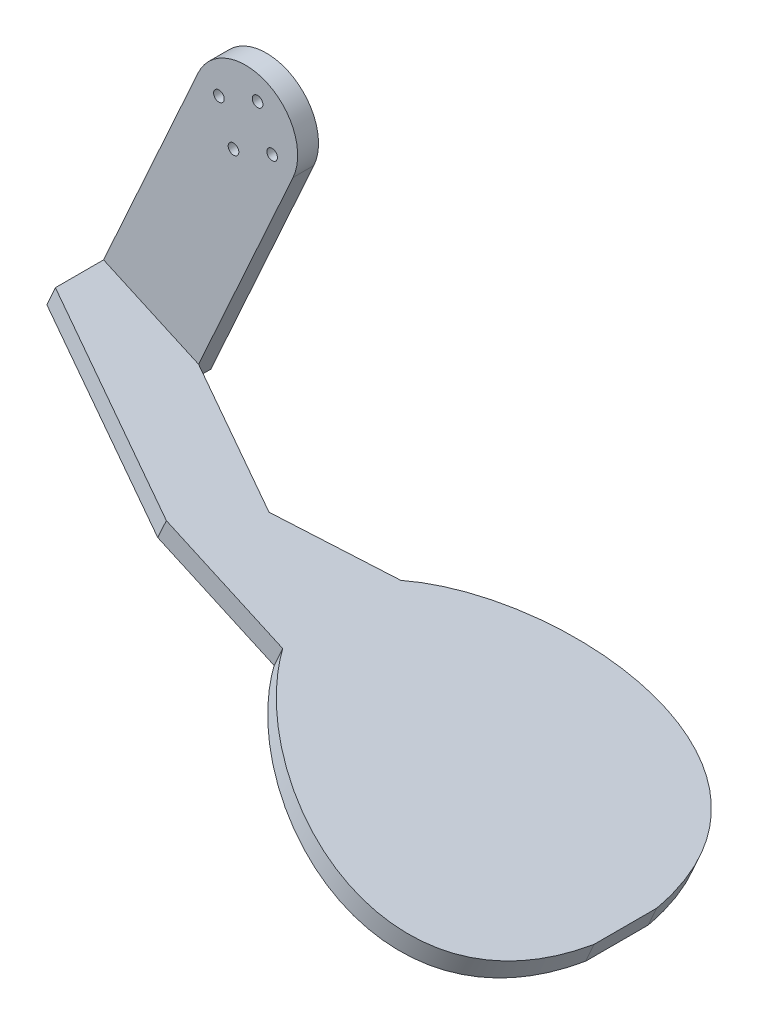
ISO-10303-21;
HEADER;
FILE_DESCRIPTION(('STEP AP214'),'2;1');
FILE_NAME('part.step','',(''),(''),'','','');
FILE_SCHEMA(('AUTOMOTIVE_DESIGN { 1 0 10303 214 1 1 1 1 }'));
ENDSEC;
DATA;
#1=APPLICATION_CONTEXT('core data for automotive mechanical design processes');
#2=APPLICATION_PROTOCOL_DEFINITION('international standard','automotive_design',2000,#1);
#3=PRODUCT_CONTEXT('',#1,'mechanical');
#4=PRODUCT('Part','Part','',(#3));
#5=PRODUCT_RELATED_PRODUCT_CATEGORY('part','',(#4));
#6=PRODUCT_DEFINITION_FORMATION('','',#4);
#7=PRODUCT_DEFINITION_CONTEXT('part definition',#1,'design');
#8=PRODUCT_DEFINITION('design','',#6,#7);
#9=PRODUCT_DEFINITION_SHAPE('','',#8);
#10=(LENGTH_UNIT() NAMED_UNIT(*) SI_UNIT(.MILLI.,.METRE.));
#11=(NAMED_UNIT(*) PLANE_ANGLE_UNIT() SI_UNIT($,.RADIAN.));
#12=(NAMED_UNIT(*) SI_UNIT($,.STERADIAN.) SOLID_ANGLE_UNIT());
#13=UNCERTAINTY_MEASURE_WITH_UNIT(LENGTH_MEASURE(1.E-05),#10,'distance_accuracy_value','');
#14=(GEOMETRIC_REPRESENTATION_CONTEXT(3) GLOBAL_UNCERTAINTY_ASSIGNED_CONTEXT((#13)) GLOBAL_UNIT_ASSIGNED_CONTEXT((#10,
#11,#12)) REPRESENTATION_CONTEXT('',''));
#15=CARTESIAN_POINT('',(0.,0.,0.));
#16=DIRECTION('',(0.,0.,1.));
#17=DIRECTION('',(1.,0.,0.));
#18=AXIS2_PLACEMENT_3D('',#15,#16,#17);
#19=CARTESIAN_POINT('',(0.,0.,3.));
#20=DIRECTION('',(0.,0.,1.));
#21=DIRECTION('',(1.,0.,0.));
#22=AXIS2_PLACEMENT_3D('',#19,#20,#21);
#23=PLANE('',#22);
#24=CARTESIAN_POINT('',(-6.37863219193464,2.88323626503544,3.));
#25=DIRECTION('',(0.,0.,1.));
#26=DIRECTION('',(-1.,0.,0.));
#27=AXIS2_PLACEMENT_3D('',#24,#25,#26);
#28=CIRCLE('',#27,1.275);
#29=CARTESIAN_POINT('',(-7.65363219193464,2.88323626503544,3.));
#30=VERTEX_POINT('',#29);
#31=EDGE_CURVE('E263',#30,#30,#28,.T.);
#32=ORIENTED_EDGE('',*,*,#31,.F.);
#33=EDGE_LOOP('',(#32));
#34=FACE_BOUND('',#33,.T.);
#35=CARTESIAN_POINT('',(2.88323626503541,6.37863219193461,3.));
#36=DIRECTION('',(0.,0.,1.));
#37=DIRECTION('',(1.,0.,0.));
#38=AXIS2_PLACEMENT_3D('',#35,#36,#37);
#39=CIRCLE('',#38,1.275);
#40=CARTESIAN_POINT('',(4.15823626503541,6.37863219193461,3.));
#41=VERTEX_POINT('',#40);
#42=EDGE_CURVE('E11',#41,#41,#39,.T.);
#43=ORIENTED_EDGE('',*,*,#42,.F.);
#44=EDGE_LOOP('',(#43));
#45=FACE_BOUND('',#44,.T.);
#46=CARTESIAN_POINT('',(-2.88323626503547,-6.37863219193462,3.));
#47=DIRECTION('',(0.,0.,1.));
#48=DIRECTION('',(-1.,0.,0.));
#49=AXIS2_PLACEMENT_3D('',#46,#47,#48);
#50=CIRCLE('',#49,1.275);
#51=CARTESIAN_POINT('',(-4.15823626503547,-6.37863219193462,3.));
#52=VERTEX_POINT('',#51);
#53=EDGE_CURVE('E42',#52,#52,#50,.T.);
#54=ORIENTED_EDGE('',*,*,#53,.F.);
#55=EDGE_LOOP('',(#54));
#56=FACE_BOUND('',#55,.T.);
#57=CARTESIAN_POINT('',(6.37863219193458,-2.88323626503544,3.));
#58=DIRECTION('',(0.,0.,1.));
#59=DIRECTION('',(1.,0.,0.));
#60=AXIS2_PLACEMENT_3D('',#57,#58,#59);
#61=CIRCLE('',#60,1.275);
#62=CARTESIAN_POINT('',(7.65363219193458,-2.88323626503544,3.));
#63=VERTEX_POINT('',#62);
#64=EDGE_CURVE('E256',#63,#63,#61,.T.);
#65=ORIENTED_EDGE('',*,*,#64,.F.);
#66=EDGE_LOOP('',(#65));
#67=FACE_BOUND('',#66,.T.);
#68=DIRECTION('',(-0.411890895005062,-0.911233170276373,0.));
#69=VECTOR('',#68,1.);
#70=CARTESIAN_POINT('',(-11.3904146284547,5.14863618756329,3.));
#71=LINE('',#70,#69);
#72=CARTESIAN_POINT('',(-11.3904146284547,5.14863618756329,3.));
#73=VERTEX_POINT('',#72);
#74=CARTESIAN_POINT('',(-34.0444138537331,-44.9691881776372,3.));
#75=VERTEX_POINT('',#74);
#76=EDGE_CURVE('E54',#73,#75,#71,.T.);
#77=ORIENTED_EDGE('',*,*,#76,.T.);
#78=DIRECTION('',(0.911233170276373,-0.411890895005062,0.));
#79=VECTOR('',#78,1.);
#80=CARTESIAN_POINT('',(-34.0444138537331,-44.9691881776373,3.));
#81=LINE('',#80,#79);
#82=CARTESIAN_POINT('',(-11.2635845968238,-55.2664605527638,3.));
#83=VERTEX_POINT('',#82);
#84=EDGE_CURVE('E49',#75,#83,#81,.T.);
#85=ORIENTED_EDGE('',*,*,#84,.T.);
#86=DIRECTION('',(0.411890895005062,0.911233170276373,0.));
#87=VECTOR('',#86,1.);
#88=CARTESIAN_POINT('',(11.3904146284546,-5.14863618756328,3.));
#89=LINE('',#88,#87);
#90=CARTESIAN_POINT('',(11.3904146284546,-5.14863618756328,3.));
#91=VERTEX_POINT('',#90);
#92=EDGE_CURVE('E250',#83,#91,#89,.T.);
#93=ORIENTED_EDGE('',*,*,#92,.T.);
#94=CARTESIAN_POINT('',(0.,0.,3.));
#95=DIRECTION('',(0.,0.,1.));
#96=DIRECTION('',(1.,0.,0.));
#97=AXIS2_PLACEMENT_3D('',#94,#95,#96);
#98=CIRCLE('',#97,12.5);
#99=EDGE_CURVE('E227',#91,#73,#98,.T.);
#100=ORIENTED_EDGE('',*,*,#99,.T.);
#101=EDGE_LOOP('',(#77,#85,#93,#100));
#102=FACE_BOUND('',#101,.T.);
#103=ADVANCED_FACE('F35',(#34,#45,#56,#67,#102),#23,.T.);
#104=CARTESIAN_POINT('',(2.88323626503541,6.37863219193461,3.));
#105=DIRECTION('',(0.,0.,-1.));
#106=DIRECTION('',(-1.,0.,0.));
#107=AXIS2_PLACEMENT_3D('',#104,#105,#106);
#108=CYLINDRICAL_SURFACE('',#107,1.275);
#109=ORIENTED_EDGE('',*,*,#42,.T.);
#110=EDGE_LOOP('',(#109));
#111=FACE_BOUND('',#110,.T.);
#112=CARTESIAN_POINT('',(2.88323626503541,6.37863219193461,-2.));
#113=DIRECTION('',(0.,0.,1.));
#114=DIRECTION('',(1.,0.,0.));
#115=AXIS2_PLACEMENT_3D('',#112,#113,#114);
#116=CIRCLE('',#115,1.275);
#117=CARTESIAN_POINT('',(4.15823626503541,6.37863219193461,-2.));
#118=VERTEX_POINT('',#117);
#119=EDGE_CURVE('E225',#118,#118,#116,.T.);
#120=ORIENTED_EDGE('',*,*,#119,.F.);
#121=EDGE_LOOP('',(#120));
#122=FACE_BOUND('',#121,.T.);
#123=ADVANCED_FACE('F213',(#111,#122),#108,.F.);
#124=CARTESIAN_POINT('',(-2.88323626503547,-6.37863219193462,3.));
#125=DIRECTION('',(0.,0.,-1.));
#126=DIRECTION('',(-1.,0.,0.));
#127=AXIS2_PLACEMENT_3D('',#124,#125,#126);
#128=CYLINDRICAL_SURFACE('',#127,1.275);
#129=ORIENTED_EDGE('',*,*,#53,.T.);
#130=EDGE_LOOP('',(#129));
#131=FACE_BOUND('',#130,.T.);
#132=CARTESIAN_POINT('',(-2.88323626503546,-6.37863219193461,-2.));
#133=DIRECTION('',(0.,0.,1.));
#134=DIRECTION('',(-1.,0.,0.));
#135=AXIS2_PLACEMENT_3D('',#132,#133,#134);
#136=CIRCLE('',#135,1.275);
#137=CARTESIAN_POINT('',(-4.15823626503546,-6.37863219193461,-2.));
#138=VERTEX_POINT('',#137);
#139=EDGE_CURVE('E228',#138,#138,#136,.T.);
#140=ORIENTED_EDGE('',*,*,#139,.F.);
#141=EDGE_LOOP('',(#140));
#142=FACE_BOUND('',#141,.T.);
#143=ADVANCED_FACE('F210',(#131,#142),#128,.F.);
#144=CARTESIAN_POINT('',(-6.37863219193464,2.88323626503544,3.));
#145=DIRECTION('',(0.,0.,-1.));
#146=DIRECTION('',(-1.,0.,0.));
#147=AXIS2_PLACEMENT_3D('',#144,#145,#146);
#148=CYLINDRICAL_SURFACE('',#147,1.275);
#149=ORIENTED_EDGE('',*,*,#31,.T.);
#150=EDGE_LOOP('',(#149));
#151=FACE_BOUND('',#150,.T.);
#152=CARTESIAN_POINT('',(-6.37863219193464,2.88323626503543,-2.));
#153=DIRECTION('',(0.,0.,1.));
#154=DIRECTION('',(-1.,0.,0.));
#155=AXIS2_PLACEMENT_3D('',#152,#153,#154);
#156=CIRCLE('',#155,1.275);
#157=CARTESIAN_POINT('',(-7.65363219193464,2.88323626503543,-2.));
#158=VERTEX_POINT('',#157);
#159=EDGE_CURVE('E232',#158,#158,#156,.T.);
#160=ORIENTED_EDGE('',*,*,#159,.F.);
#161=EDGE_LOOP('',(#160));
#162=FACE_BOUND('',#161,.T.);
#163=ADVANCED_FACE('F206',(#151,#162),#148,.F.);
#164=CARTESIAN_POINT('',(6.37863219193458,-2.88323626503544,3.));
#165=DIRECTION('',(0.,0.,-1.));
#166=DIRECTION('',(-1.,0.,0.));
#167=AXIS2_PLACEMENT_3D('',#164,#165,#166);
#168=CYLINDRICAL_SURFACE('',#167,1.275);
#169=ORIENTED_EDGE('',*,*,#64,.T.);
#170=EDGE_LOOP('',(#169));
#171=FACE_BOUND('',#170,.T.);
#172=CARTESIAN_POINT('',(6.37863219193458,-2.88323626503544,-2.));
#173=DIRECTION('',(0.,0.,1.));
#174=DIRECTION('',(1.,0.,0.));
#175=AXIS2_PLACEMENT_3D('',#172,#173,#174);
#176=CIRCLE('',#175,1.275);
#177=CARTESIAN_POINT('',(7.65363219193458,-2.88323626503544,-2.));
#178=VERTEX_POINT('',#177);
#179=EDGE_CURVE('E274',#178,#178,#176,.T.);
#180=ORIENTED_EDGE('',*,*,#179,.F.);
#181=EDGE_LOOP('',(#180));
#182=FACE_BOUND('',#181,.T.);
#183=ADVANCED_FACE('F202',(#171,#182),#168,.F.);
#184=CARTESIAN_POINT('',(0.,0.,-2.));
#185=DIRECTION('',(0.,0.,1.));
#186=DIRECTION('',(1.,0.,0.));
#187=AXIS2_PLACEMENT_3D('',#184,#185,#186);
#188=CYLINDRICAL_SURFACE('',#187,12.5);
#189=ORIENTED_EDGE('',*,*,#99,.F.);
#190=DIRECTION('',(0.,0.,1.));
#191=VECTOR('',#190,1.);
#192=CARTESIAN_POINT('',(11.3904146284546,-5.14863618756328,-2.));
#193=LINE('',#192,#191);
#194=CARTESIAN_POINT('',(11.3904146284546,-5.14863618756328,-2.));
#195=VERTEX_POINT('',#194);
#196=EDGE_CURVE('E253',#195,#91,#193,.T.);
#197=ORIENTED_EDGE('',*,*,#196,.F.);
#198=CARTESIAN_POINT('',(0.,0.,-2.));
#199=DIRECTION('',(0.,0.,1.));
#200=DIRECTION('',(1.,0.,0.));
#201=AXIS2_PLACEMENT_3D('',#198,#199,#200);
#202=CIRCLE('',#201,12.5);
#203=CARTESIAN_POINT('',(-11.3904146284547,5.14863618756329,-2.));
#204=VERTEX_POINT('',#203);
#205=EDGE_CURVE('E236',#195,#204,#202,.T.);
#206=ORIENTED_EDGE('',*,*,#205,.T.);
#207=DIRECTION('',(0.,0.,1.));
#208=VECTOR('',#207,1.);
#209=CARTESIAN_POINT('',(-11.3904146284547,5.14863618756329,-2.));
#210=LINE('',#209,#208);
#211=EDGE_CURVE('E247',#204,#73,#210,.T.);
#212=ORIENTED_EDGE('',*,*,#211,.T.);
#213=EDGE_LOOP('',(#189,#197,#206,#212));
#214=FACE_BOUND('',#213,.T.);
#215=ADVANCED_FACE('F193',(#214),#188,.T.);
#216=CARTESIAN_POINT('',(11.3904146284546,-5.14863618756328,-2.));
#217=DIRECTION('',(0.911233170276373,-0.411890895005062,0.));
#218=DIRECTION('',(0.411890895005062,0.911233170276373,0.));
#219=AXIS2_PLACEMENT_3D('',#216,#217,#218);
#220=PLANE('',#219);
#221=CARTESIAN_POINT('',(-13.3230390718491,-59.8226264041457,3.));
#222=VERTEX_POINT('',#221);
#223=EDGE_CURVE('E240',#222,#83,#89,.T.);
#224=ORIENTED_EDGE('',*,*,#223,.F.);
#225=DIRECTION('',(0.,0.,1.));
#226=VECTOR('',#225,1.);
#227=CARTESIAN_POINT('',(-13.3230390718491,-59.8226264041457,-2.));
#228=LINE('',#227,#226);
#229=CARTESIAN_POINT('',(-13.3230390718491,-59.8226264041457,-2.));
#230=VERTEX_POINT('',#229);
#231=EDGE_CURVE('E257',#230,#222,#228,.T.);
#232=ORIENTED_EDGE('',*,*,#231,.F.);
#233=DIRECTION('',(0.411890895005062,0.911233170276373,0.));
#234=VECTOR('',#233,1.);
#235=CARTESIAN_POINT('',(11.3904146284546,-5.14863618756328,-2.));
#236=LINE('',#235,#234);
#237=EDGE_CURVE('E245',#230,#195,#236,.T.);
#238=ORIENTED_EDGE('',*,*,#237,.T.);
#239=ORIENTED_EDGE('',*,*,#196,.T.);
#240=ORIENTED_EDGE('',*,*,#92,.F.);
#241=EDGE_LOOP('',(#224,#232,#238,#239,#240));
#242=FACE_BOUND('',#241,.T.);
#243=ADVANCED_FACE('F189',(#242),#220,.T.);
#244=CARTESIAN_POINT('',(-13.3230390718491,-59.8226264041457,-2.));
#245=DIRECTION('',(-0.411890895005062,-0.911233170276373,0.));
#246=DIRECTION('',(0.911233170276373,-0.411890895005062,0.));
#247=AXIS2_PLACEMENT_3D('',#244,#245,#246);
#248=PLANE('',#247);
#249=ORIENTED_EDGE('',*,*,#231,.T.);
#250=DIRECTION('',(0.862608684222671,-0.389911906823864,0.322296389710792));
#251=VECTOR('',#250,1.);
#252=CARTESIAN_POINT('',(-13.323039071849,-59.8226264041457,3.));
#253=LINE('',#252,#251);
#254=CARTESIAN_POINT('',(13.6509057318031,-72.0152491371655,13.0782720896317));
#255=VERTEX_POINT('',#254);
#256=EDGE_CURVE('E309',#222,#255,#253,.T.);
#257=ORIENTED_EDGE('',*,*,#256,.T.);
#258=DIRECTION('',(0.819925869175354,-0.370618641977235,-0.436306533615977));
#259=VECTOR('',#258,1.);
#260=CARTESIAN_POINT('',(34.2779269582144,-81.3389683688284,2.10203086044572));
#261=LINE('',#260,#259);
#262=CARTESIAN_POINT('',(34.2779269582144,-81.3389683688284,2.10203086044572));
#263=VERTEX_POINT('',#262);
#264=EDGE_CURVE('E303',#255,#263,#261,.T.);
#265=ORIENTED_EDGE('',*,*,#264,.T.);
#266=CARTESIAN_POINT('',(34.2779269582144,-81.3389683688284,2.10203086044572));
#267=CARTESIAN_POINT('',(49.7906158920743,-88.3509336235225,-22.4198920206127));
#268=CARTESIAN_POINT('',(96.1335855652667,-109.298642594756,-37.6494657311894));
#269=CARTESIAN_POINT('',(102.29569044997,-112.084005308567,8.7620308604458));
#270=B_SPLINE_CURVE_WITH_KNOTS('',3,(#266,#267,#268,#269),.UNSPECIFIED.,.F.,.F.,(4,4),(0.,1.),.UNSPECIFIED.);
#271=CARTESIAN_POINT('',(102.29569044997,-112.084005308567,8.7620308604458));
#272=VERTEX_POINT('',#271);
#273=EDGE_CURVE('E298',#263,#272,#270,.T.);
#274=ORIENTED_EDGE('',*,*,#273,.T.);
#275=DIRECTION('',(0.,0.,1.));
#276=VECTOR('',#275,1.);
#277=CARTESIAN_POINT('',(102.29569044997,-112.084005308567,8.7620308604458));
#278=LINE('',#277,#276);
#279=CARTESIAN_POINT('',(102.29569044997,-112.084005308567,23.7620308604458));
#280=VERTEX_POINT('',#279);
#281=EDGE_CURVE('E292',#272,#280,#278,.T.);
#282=ORIENTED_EDGE('',*,*,#281,.T.);
#283=CARTESIAN_POINT('',(102.29569044997,-112.084005308567,23.7620308604458));
#284=CARTESIAN_POINT('',(96.1335855652869,-109.298642594765,70.1735274521018));
#285=CARTESIAN_POINT('',(49.7906158920543,-88.3509336235135,54.943953741536));
#286=CARTESIAN_POINT('',(34.2779269582145,-81.3389683688284,30.4220308604457));
#287=B_SPLINE_CURVE_WITH_KNOTS('',3,(#283,#284,#285,#286),.UNSPECIFIED.,.F.,.F.,(4,4),(0.,1.),.UNSPECIFIED.);
#288=CARTESIAN_POINT('',(34.2779269582145,-81.3389683688284,30.4220308604457));
#289=VERTEX_POINT('',#288);
#290=EDGE_CURVE('E145',#280,#289,#287,.T.);
#291=ORIENTED_EDGE('',*,*,#290,.T.);
#292=DIRECTION('',(-0.911233170276373,0.411890895005062,0.));
#293=VECTOR('',#292,1.);
#294=CARTESIAN_POINT('',(34.2779269582145,-81.3389683688284,30.4220308604457));
#295=LINE('',#294,#293);
#296=CARTESIAN_POINT('',(6.37334244186484,-68.7256826960761,30.4220308604457));
#297=VERTEX_POINT('',#296);
#298=EDGE_CURVE('E142',#289,#297,#295,.T.);
#299=ORIENTED_EDGE('',*,*,#298,.T.);
#300=DIRECTION('',(-0.862608684222672,0.389911906823864,-0.322296389710791));
#301=VECTOR('',#300,1.);
#302=CARTESIAN_POINT('',(-36.1038683287584,-49.5253540290191,14.551275178577));
#303=LINE('',#302,#301);
#304=CARTESIAN_POINT('',(-36.1038683287584,-49.5253540290191,14.551275178577));
#305=VERTEX_POINT('',#304);
#306=EDGE_CURVE('E312',#297,#305,#303,.T.);
#307=ORIENTED_EDGE('',*,*,#306,.T.);
#308=DIRECTION('',(0.,0.,1.));
#309=VECTOR('',#308,1.);
#310=CARTESIAN_POINT('',(-36.1038683287584,-49.5253540290191,-2.));
#311=LINE('',#310,#309);
#312=CARTESIAN_POINT('',(-36.1038683287584,-49.5253540290191,-2.));
#313=VERTEX_POINT('',#312);
#314=EDGE_CURVE('E124',#313,#305,#311,.T.);
#315=ORIENTED_EDGE('',*,*,#314,.F.);
#316=DIRECTION('',(0.911233170276373,-0.411890895005062,0.));
#317=VECTOR('',#316,1.);
#318=CARTESIAN_POINT('',(-13.3230390718491,-59.8226264041457,-2.));
#319=LINE('',#318,#317);
#320=EDGE_CURVE('E242',#313,#230,#319,.T.);
#321=ORIENTED_EDGE('',*,*,#320,.T.);
#322=EDGE_LOOP('',(#249,#257,#265,#274,#282,#291,#299,#307,#315,#321));
#323=FACE_BOUND('',#322,.T.);
#324=ADVANCED_FACE('F192',(#323),#248,.T.);
#325=CARTESIAN_POINT('',(-11.3904146284547,5.14863618756329,-2.));
#326=DIRECTION('',(-0.911233170276373,0.411890895005062,0.));
#327=DIRECTION('',(-0.411890895005062,-0.911233170276373,0.));
#328=AXIS2_PLACEMENT_3D('',#325,#326,#327);
#329=PLANE('',#328);
#330=ORIENTED_EDGE('',*,*,#76,.F.);
#331=ORIENTED_EDGE('',*,*,#211,.F.);
#332=DIRECTION('',(-0.411890895005062,-0.911233170276373,0.));
#333=VECTOR('',#332,1.);
#334=CARTESIAN_POINT('',(-11.3904146284547,5.14863618756329,-2.));
#335=LINE('',#334,#333);
#336=EDGE_CURVE('E239',#204,#313,#335,.T.);
#337=ORIENTED_EDGE('',*,*,#336,.T.);
#338=ORIENTED_EDGE('',*,*,#314,.T.);
#339=DIRECTION('',(-0.411890895005062,-0.911233170276373,0.));
#340=VECTOR('',#339,1.);
#341=CARTESIAN_POINT('',(-34.0444138537331,-44.9691881776372,14.551275178577));
#342=LINE('',#341,#340);
#343=CARTESIAN_POINT('',(-34.0444138537331,-44.9691881776372,14.551275178577));
#344=VERTEX_POINT('',#343);
#345=EDGE_CURVE('E119',#344,#305,#342,.T.);
#346=ORIENTED_EDGE('',*,*,#345,.F.);
#347=DIRECTION('',(0.,0.,-1.));
#348=VECTOR('',#347,1.);
#349=CARTESIAN_POINT('',(-34.0444138537331,-44.9691881776373,3.));
#350=LINE('',#349,#348);
#351=EDGE_CURVE('E122',#344,#75,#350,.T.);
#352=ORIENTED_EDGE('',*,*,#351,.T.);
#353=EDGE_LOOP('',(#330,#331,#337,#338,#346,#352));
#354=FACE_BOUND('',#353,.T.);
#355=ADVANCED_FACE('F121',(#354),#329,.T.);
#356=CARTESIAN_POINT('',(0.,0.,-2.));
#357=DIRECTION('',(0.,0.,1.));
#358=DIRECTION('',(1.,0.,0.));
#359=AXIS2_PLACEMENT_3D('',#356,#357,#358);
#360=PLANE('',#359);
#361=ORIENTED_EDGE('',*,*,#179,.T.);
#362=EDGE_LOOP('',(#361));
#363=FACE_BOUND('',#362,.T.);
#364=ORIENTED_EDGE('',*,*,#159,.T.);
#365=EDGE_LOOP('',(#364));
#366=FACE_BOUND('',#365,.T.);
#367=ORIENTED_EDGE('',*,*,#139,.T.);
#368=EDGE_LOOP('',(#367));
#369=FACE_BOUND('',#368,.T.);
#370=ORIENTED_EDGE('',*,*,#119,.T.);
#371=EDGE_LOOP('',(#370));
#372=FACE_BOUND('',#371,.T.);
#373=ORIENTED_EDGE('',*,*,#205,.F.);
#374=ORIENTED_EDGE('',*,*,#237,.F.);
#375=ORIENTED_EDGE('',*,*,#320,.F.);
#376=ORIENTED_EDGE('',*,*,#336,.F.);
#377=EDGE_LOOP('',(#373,#374,#375,#376));
#378=FACE_BOUND('',#377,.T.);
#379=ADVANCED_FACE('F185',(#363,#366,#369,#372,#378),#360,.F.);
#380=CARTESIAN_POINT('',(-34.0444138537331,-44.9691881776372,14.551275178577));
#381=DIRECTION('',(-0.293687160964794,0.132750948414878,0.946638810306967));
#382=DIRECTION('',(0.955091921536743,0.,0.2963096714845));
#383=AXIS2_PLACEMENT_3D('',#380,#381,#382);
#384=PLANE('',#383);
#385=ORIENTED_EDGE('',*,*,#306,.F.);
#386=DIRECTION('',(-0.411890895005062,-0.911233170276373,0.));
#387=VECTOR('',#386,1.);
#388=CARTESIAN_POINT('',(8.43279691689015,-64.1695168446942,30.4220308604457));
#389=LINE('',#388,#387);
#390=CARTESIAN_POINT('',(8.43279691689015,-64.1695168446942,30.4220308604457));
#391=VERTEX_POINT('',#390);
#392=EDGE_CURVE('E141',#391,#297,#389,.T.);
#393=ORIENTED_EDGE('',*,*,#392,.F.);
#394=DIRECTION('',(-0.862608684222672,0.389911906823864,-0.322296389710791));
#395=VECTOR('',#394,1.);
#396=CARTESIAN_POINT('',(-34.0444138537331,-44.9691881776372,14.551275178577));
#397=LINE('',#396,#395);
#398=EDGE_CURVE('E136',#391,#344,#397,.T.);
#399=ORIENTED_EDGE('',*,*,#398,.T.);
#400=ORIENTED_EDGE('',*,*,#345,.T.);
#401=EDGE_LOOP('',(#385,#393,#399,#400));
#402=FACE_BOUND('',#401,.T.);
#403=ADVANCED_FACE('F140',(#402),#384,.T.);
#404=CARTESIAN_POINT('',(36.3373814332398,-76.7828025174466,30.4220308604457));
#405=DIRECTION('',(0.,0.,1.));
#406=DIRECTION('',(1.,0.,0.));
#407=AXIS2_PLACEMENT_3D('',#404,#405,#406);
#408=PLANE('',#407);
#409=ORIENTED_EDGE('',*,*,#298,.F.);
#410=DIRECTION('',(-0.411890895005062,-0.911233170276373,0.));
#411=VECTOR('',#410,1.);
#412=CARTESIAN_POINT('',(36.3373814332398,-76.7828025174466,30.4220308604457));
#413=LINE('',#412,#411);
#414=CARTESIAN_POINT('',(36.3373814332398,-76.7828025174466,30.4220308604457));
#415=VERTEX_POINT('',#414);
#416=EDGE_CURVE('E277',#415,#289,#413,.T.);
#417=ORIENTED_EDGE('',*,*,#416,.F.);
#418=DIRECTION('',(-0.911233170276373,0.411890895005062,0.));
#419=VECTOR('',#418,1.);
#420=CARTESIAN_POINT('',(36.3373814332398,-76.7828025174466,30.4220308604457));
#421=LINE('',#420,#419);
#422=EDGE_CURVE('E130',#415,#391,#421,.T.);
#423=ORIENTED_EDGE('',*,*,#422,.T.);
#424=ORIENTED_EDGE('',*,*,#392,.T.);
#425=EDGE_LOOP('',(#409,#417,#423,#424));
#426=FACE_BOUND('',#425,.T.);
#427=ADVANCED_FACE('F184',(#426),#408,.T.);
#428=CARTESIAN_POINT('',(104.355144924995,-107.527839457185,23.7620308604458));
#429=CARTESIAN_POINT('',(98.1930400403122,-104.742476743383,70.1735274521018));
#430=CARTESIAN_POINT('',(51.8500703670797,-83.7947677721316,54.943953741536));
#431=CARTESIAN_POINT('',(36.3373814332398,-76.7828025174466,30.4220308604457));
#432=B_SPLINE_CURVE_WITH_KNOTS('',3,(#428,#429,#430,#431),.UNSPECIFIED.,.F.,.F.,(4,4),(0.,1.),.UNSPECIFIED.);
#433=DIRECTION('',(-0.411890895005062,-0.911233170276373,0.));
#434=VECTOR('',#433,1.);
#435=SURFACE_OF_LINEAR_EXTRUSION('',#432,#434);
#436=ORIENTED_EDGE('',*,*,#290,.F.);
#437=DIRECTION('',(-0.411890895005062,-0.911233170276373,0.));
#438=VECTOR('',#437,1.);
#439=CARTESIAN_POINT('',(104.355144924995,-107.527839457185,23.7620308604458));
#440=LINE('',#439,#438);
#441=CARTESIAN_POINT('',(104.355144924995,-107.527839457185,23.7620308604458));
#442=VERTEX_POINT('',#441);
#443=EDGE_CURVE('E285',#442,#280,#440,.T.);
#444=ORIENTED_EDGE('',*,*,#443,.F.);
#445=EDGE_CURVE('E314',#442,#415,#432,.T.);
#446=ORIENTED_EDGE('',*,*,#445,.T.);
#447=ORIENTED_EDGE('',*,*,#416,.T.);
#448=EDGE_LOOP('',(#436,#444,#446,#447));
#449=FACE_BOUND('',#448,.T.);
#450=ADVANCED_FACE('F322',(#449),#435,.T.);
#451=CARTESIAN_POINT('',(104.355144924995,-107.527839457185,8.7620308604458));
#452=DIRECTION('',(0.911233170276373,-0.411890895005062,0.));
#453=DIRECTION('',(0.411890895005062,0.911233170276373,0.));
#454=AXIS2_PLACEMENT_3D('',#451,#452,#453);
#455=PLANE('',#454);
#456=ORIENTED_EDGE('',*,*,#281,.F.);
#457=DIRECTION('',(-0.411890895005062,-0.911233170276373,0.));
#458=VECTOR('',#457,1.);
#459=CARTESIAN_POINT('',(104.355144924995,-107.527839457185,8.7620308604458));
#460=LINE('',#459,#458);
#461=CARTESIAN_POINT('',(104.355144924995,-107.527839457185,8.7620308604458));
#462=VERTEX_POINT('',#461);
#463=EDGE_CURVE('E283',#462,#272,#460,.T.);
#464=ORIENTED_EDGE('',*,*,#463,.F.);
#465=DIRECTION('',(0.,0.,1.));
#466=VECTOR('',#465,1.);
#467=CARTESIAN_POINT('',(104.355144924995,-107.527839457185,8.7620308604458));
#468=LINE('',#467,#466);
#469=EDGE_CURVE('E161',#462,#442,#468,.T.);
#470=ORIENTED_EDGE('',*,*,#469,.T.);
#471=ORIENTED_EDGE('',*,*,#443,.T.);
#472=EDGE_LOOP('',(#456,#464,#470,#471));
#473=FACE_BOUND('',#472,.T.);
#474=ADVANCED_FACE('F172',(#473),#455,.T.);
#475=CARTESIAN_POINT('',(36.3373814332397,-76.7828025174465,2.10203086044572));
#476=CARTESIAN_POINT('',(51.8500703670996,-83.7947677721406,-22.4198920206127));
#477=CARTESIAN_POINT('',(98.1930400402921,-104.742476743374,-37.6494657311894));
#478=CARTESIAN_POINT('',(104.355144924995,-107.527839457185,8.7620308604458));
#479=B_SPLINE_CURVE_WITH_KNOTS('',3,(#475,#476,#477,#478),.UNSPECIFIED.,.F.,.F.,(4,4),(0.,1.),.UNSPECIFIED.);
#480=DIRECTION('',(-0.411890895005062,-0.911233170276373,0.));
#481=VECTOR('',#480,1.);
#482=SURFACE_OF_LINEAR_EXTRUSION('',#479,#481);
#483=ORIENTED_EDGE('',*,*,#273,.F.);
#484=DIRECTION('',(-0.411890895005062,-0.911233170276373,0.));
#485=VECTOR('',#484,1.);
#486=CARTESIAN_POINT('',(36.3373814332397,-76.7828025174465,2.10203086044572));
#487=LINE('',#486,#485);
#488=CARTESIAN_POINT('',(36.3373814332397,-76.7828025174465,2.10203086044572));
#489=VERTEX_POINT('',#488);
#490=EDGE_CURVE('E281',#489,#263,#487,.T.);
#491=ORIENTED_EDGE('',*,*,#490,.F.);
#492=EDGE_CURVE('E155',#489,#462,#479,.T.);
#493=ORIENTED_EDGE('',*,*,#492,.T.);
#494=ORIENTED_EDGE('',*,*,#463,.T.);
#495=EDGE_LOOP('',(#483,#491,#493,#494));
#496=FACE_BOUND('',#495,.T.);
#497=ADVANCED_FACE('F167',(#496),#482,.T.);
#498=CARTESIAN_POINT('',(36.3373814332397,-76.7828025174465,2.10203086044572));
#499=DIRECTION('',(-0.397576985839181,0.179710688627641,-0.899798093309833));
#500=DIRECTION('',(-0.9146896924729,0.,0.404156858761338));
#501=AXIS2_PLACEMENT_3D('',#498,#499,#500);
#502=PLANE('',#501);
#503=ORIENTED_EDGE('',*,*,#264,.F.);
#504=DIRECTION('',(-0.411890895005062,-0.911233170276373,0.));
#505=VECTOR('',#504,1.);
#506=CARTESIAN_POINT('',(15.7103602068284,-67.4590832857836,13.0782720896317));
#507=LINE('',#506,#505);
#508=CARTESIAN_POINT('',(15.7103602068284,-67.4590832857836,13.0782720896317));
#509=VERTEX_POINT('',#508);
#510=EDGE_CURVE('E129',#509,#255,#507,.T.);
#511=ORIENTED_EDGE('',*,*,#510,.F.);
#512=DIRECTION('',(0.819925869175354,-0.370618641977235,-0.436306533615977));
#513=VECTOR('',#512,1.);
#514=CARTESIAN_POINT('',(36.3373814332397,-76.7828025174465,2.10203086044572));
#515=LINE('',#514,#513);
#516=EDGE_CURVE('E152',#509,#489,#515,.T.);
#517=ORIENTED_EDGE('',*,*,#516,.T.);
#518=ORIENTED_EDGE('',*,*,#490,.T.);
#519=EDGE_LOOP('',(#503,#511,#517,#518));
#520=FACE_BOUND('',#519,.T.);
#521=ADVANCED_FACE('F171',(#520),#502,.T.);
#522=CARTESIAN_POINT('',(-11.2635845968237,-55.2664605527638,3.));
#523=DIRECTION('',(0.293687160964794,-0.132750948414878,-0.946638810306967));
#524=DIRECTION('',(-0.955091921536743,0.,-0.2963096714845));
#525=AXIS2_PLACEMENT_3D('',#522,#523,#524);
#526=PLANE('',#525);
#527=ORIENTED_EDGE('',*,*,#256,.F.);
#528=ORIENTED_EDGE('',*,*,#223,.T.);
#529=DIRECTION('',(0.862608684222671,-0.389911906823864,0.322296389710792));
#530=VECTOR('',#529,1.);
#531=CARTESIAN_POINT('',(-11.2635845968237,-55.2664605527638,3.));
#532=LINE('',#531,#530);
#533=EDGE_CURVE('E149',#83,#509,#532,.T.);
#534=ORIENTED_EDGE('',*,*,#533,.T.);
#535=ORIENTED_EDGE('',*,*,#510,.T.);
#536=EDGE_LOOP('',(#527,#528,#534,#535));
#537=FACE_BOUND('',#536,.T.);
#538=ADVANCED_FACE('F177',(#537),#526,.T.);
#539=CARTESIAN_POINT('',(73.8527321975514,-93.7402969401469,53.6920631627256));
#540=DIRECTION('',(-0.411890895005062,-0.911233170276373,0.));
#541=DIRECTION('',(0.911233170276373,-0.411890895005062,0.));
#542=AXIS2_PLACEMENT_3D('',#539,#540,#541);
#543=PLANE('',#542);
#544=ORIENTED_EDGE('',*,*,#398,.F.);
#545=ORIENTED_EDGE('',*,*,#422,.F.);
#546=ORIENTED_EDGE('',*,*,#445,.F.);
#547=ORIENTED_EDGE('',*,*,#469,.F.);
#548=ORIENTED_EDGE('',*,*,#492,.F.);
#549=ORIENTED_EDGE('',*,*,#516,.F.);
#550=ORIENTED_EDGE('',*,*,#533,.F.);
#551=ORIENTED_EDGE('',*,*,#84,.F.);
#552=ORIENTED_EDGE('',*,*,#351,.F.);
#553=EDGE_LOOP('',(#544,#545,#546,#547,#548,#549,#550,#551,#552));
#554=FACE_BOUND('',#553,.T.);
#555=ADVANCED_FACE('F134',(#554),#543,.F.);
#556=CLOSED_SHELL('',(#103,#123,#143,#163,#183,#215,#243,#324,#355,#379,#403,#427,#450,#474,
#497,#521,#538,#555));
#557=MANIFOLD_SOLID_BREP('B2',#556);
#558=ADVANCED_BREP_SHAPE_REPRESENTATION('',(#18,#557),#14);
#559=SHAPE_DEFINITION_REPRESENTATION(#9,#558);
ENDSEC;
END-ISO-10303-21;
